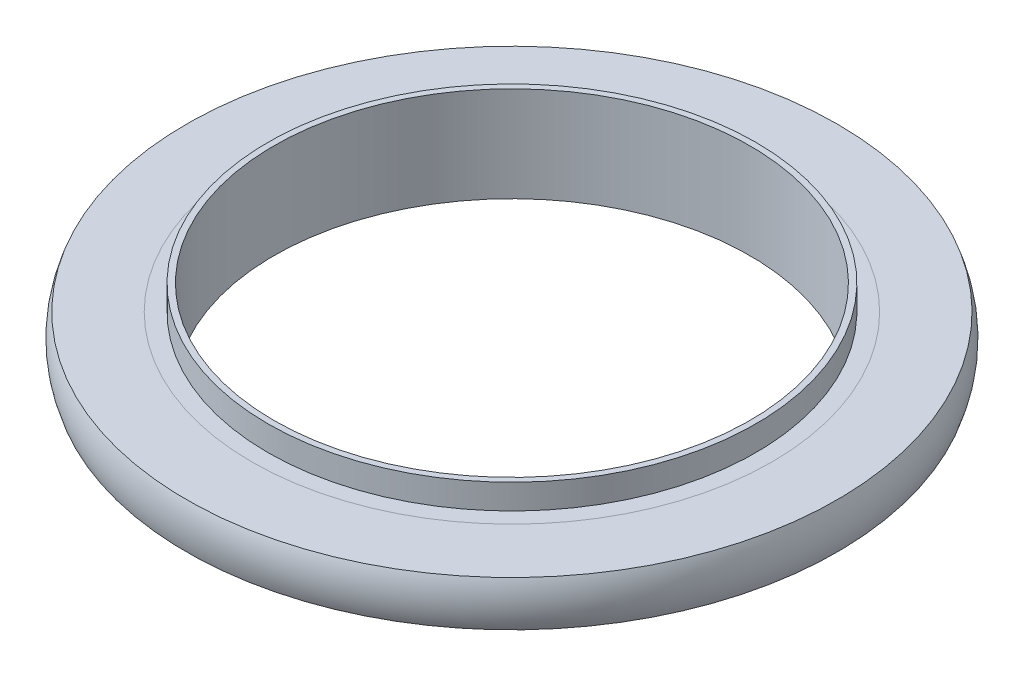
ISO-10303-21;
HEADER;
FILE_DESCRIPTION(('STEP AP214'),'2;1');
FILE_NAME('part.step','',(''),(''),'','','');
FILE_SCHEMA(('AUTOMOTIVE_DESIGN { 1 0 10303 214 1 1 1 1 }'));
ENDSEC;
DATA;
#1=APPLICATION_CONTEXT('core data for automotive mechanical design processes');
#2=APPLICATION_PROTOCOL_DEFINITION('international standard','automotive_design',2000,#1);
#3=PRODUCT_CONTEXT('',#1,'mechanical');
#4=PRODUCT('Part','Part','',(#3));
#5=PRODUCT_RELATED_PRODUCT_CATEGORY('part','',(#4));
#6=PRODUCT_DEFINITION_FORMATION('','',#4);
#7=PRODUCT_DEFINITION_CONTEXT('part definition',#1,'design');
#8=PRODUCT_DEFINITION('design','',#6,#7);
#9=PRODUCT_DEFINITION_SHAPE('','',#8);
#10=(LENGTH_UNIT() NAMED_UNIT(*) SI_UNIT(.MILLI.,.METRE.));
#11=(NAMED_UNIT(*) PLANE_ANGLE_UNIT() SI_UNIT($,.RADIAN.));
#12=(NAMED_UNIT(*) SI_UNIT($,.STERADIAN.) SOLID_ANGLE_UNIT());
#13=UNCERTAINTY_MEASURE_WITH_UNIT(LENGTH_MEASURE(1.E-05),#10,'distance_accuracy_value','');
#14=(GEOMETRIC_REPRESENTATION_CONTEXT(3) GLOBAL_UNCERTAINTY_ASSIGNED_CONTEXT((#13)) GLOBAL_UNIT_ASSIGNED_CONTEXT((#10,
#11,#12)) REPRESENTATION_CONTEXT('',''));
#15=CARTESIAN_POINT('',(0.,0.,0.));
#16=DIRECTION('',(0.,0.,1.));
#17=DIRECTION('',(1.,0.,0.));
#18=AXIS2_PLACEMENT_3D('',#15,#16,#17);
#19=CARTESIAN_POINT('',(0.,0.,0.));
#20=DIRECTION('',(0.,-1.,0.));
#21=DIRECTION('',(0.,0.,-1.));
#22=AXIS2_PLACEMENT_3D('',#19,#20,#21);
#23=TOROIDAL_SURFACE('',#22,26.8,5.3);
#24=CARTESIAN_POINT('',(0.,-1.905,0.));
#25=DIRECTION('',(0.,-1.,0.));
#26=DIRECTION('',(0.,0.,-1.));
#27=AXIS2_PLACEMENT_3D('',#24,#25,#26);
#28=CIRCLE('',#27,21.8541962230594);
#29=CARTESIAN_POINT('',(0.,-1.905,-21.8541962230594));
#30=VERTEX_POINT('',#29);
#31=EDGE_CURVE('E11',#30,#30,#28,.T.);
#32=ORIENTED_EDGE('',*,*,#31,.T.);
#33=EDGE_LOOP('',(#32));
#34=FACE_BOUND('',#33,.T.);
#35=CARTESIAN_POINT('',(0.,1.905,0.));
#36=DIRECTION('',(0.,-1.,0.));
#37=DIRECTION('',(0.,0.,-1.));
#38=AXIS2_PLACEMENT_3D('',#35,#36,#37);
#39=CIRCLE('',#38,21.8541962230594);
#40=CARTESIAN_POINT('',(0.,1.905,-21.8541962230594));
#41=VERTEX_POINT('',#40);
#42=EDGE_CURVE('E57',#41,#41,#39,.T.);
#43=ORIENTED_EDGE('',*,*,#42,.F.);
#44=EDGE_LOOP('',(#43));
#45=FACE_BOUND('',#44,.T.);
#46=ADVANCED_FACE('F43',(#34,#45),#23,.T.);
#47=CARTESIAN_POINT('',(21.8541962230594,-1.905,0.));
#48=DIRECTION('',(0.,-1.,0.));
#49=DIRECTION('',(0.,0.,-1.));
#50=AXIS2_PLACEMENT_3D('',#47,#48,#49);
#51=PLANE('',#50);
#52=CARTESIAN_POINT('',(0.,-1.905,0.));
#53=DIRECTION('',(0.,-1.,0.));
#54=DIRECTION('',(0.,0.,-1.));
#55=AXIS2_PLACEMENT_3D('',#52,#53,#54);
#56=CIRCLE('',#55,27.3458037769406);
#57=CARTESIAN_POINT('',(0.,-1.905,-27.3458037769406));
#58=VERTEX_POINT('',#57);
#59=EDGE_CURVE('E49',#58,#58,#56,.T.);
#60=ORIENTED_EDGE('',*,*,#59,.T.);
#61=EDGE_LOOP('',(#60));
#62=FACE_BOUND('',#61,.T.);
#63=ORIENTED_EDGE('',*,*,#31,.F.);
#64=EDGE_LOOP('',(#63));
#65=FACE_BOUND('',#64,.T.);
#66=ADVANCED_FACE('F67',(#62,#65),#51,.T.);
#67=CARTESIAN_POINT('',(0.,0.,0.));
#68=DIRECTION('',(0.,-1.,0.));
#69=DIRECTION('',(0.,0.,-1.));
#70=AXIS2_PLACEMENT_3D('',#67,#68,#69);
#71=TOROIDAL_SURFACE('',#70,22.4,5.3);
#72=CARTESIAN_POINT('',(0.,1.905,0.));
#73=DIRECTION('',(0.,-1.,0.));
#74=DIRECTION('',(0.,0.,-1.));
#75=AXIS2_PLACEMENT_3D('',#72,#73,#74);
#76=CIRCLE('',#75,27.3458037769406);
#77=CARTESIAN_POINT('',(0.,1.905,-27.3458037769406));
#78=VERTEX_POINT('',#77);
#79=EDGE_CURVE('E53',#78,#78,#76,.T.);
#80=ORIENTED_EDGE('',*,*,#79,.T.);
#81=EDGE_LOOP('',(#80));
#82=FACE_BOUND('',#81,.T.);
#83=ORIENTED_EDGE('',*,*,#59,.F.);
#84=EDGE_LOOP('',(#83));
#85=FACE_BOUND('',#84,.T.);
#86=ADVANCED_FACE('F71',(#82,#85),#71,.T.);
#87=CARTESIAN_POINT('',(21.8541962230594,1.905,0.));
#88=DIRECTION('',(0.,1.,0.));
#89=DIRECTION('',(0.,0.,1.));
#90=AXIS2_PLACEMENT_3D('',#87,#88,#89);
#91=PLANE('',#90);
#92=ORIENTED_EDGE('',*,*,#42,.T.);
#93=EDGE_LOOP('',(#92));
#94=FACE_BOUND('',#93,.T.);
#95=ORIENTED_EDGE('',*,*,#79,.F.);
#96=EDGE_LOOP('',(#95));
#97=FACE_BOUND('',#96,.T.);
#98=ADVANCED_FACE('F63',(#94,#97),#91,.T.);
#99=CLOSED_SHELL('',(#46,#66,#86,#98));
#100=MANIFOLD_SOLID_BREP('B2',#99);
#101=CARTESIAN_POINT('',(20.,4.,0.));
#102=DIRECTION('',(0.,-1.,0.));
#103=DIRECTION('',(0.,0.,-1.));
#104=AXIS2_PLACEMENT_3D('',#101,#102,#103);
#105=PLANE('',#104);
#106=CARTESIAN_POINT('',(0.,4.,0.));
#107=DIRECTION('',(0.,1.,0.));
#108=DIRECTION('',(0.,0.,1.));
#109=AXIS2_PLACEMENT_3D('',#106,#107,#108);
#110=CIRCLE('',#109,20.);
#111=CARTESIAN_POINT('',(0.,4.,20.));
#112=VERTEX_POINT('',#111);
#113=EDGE_CURVE('E42',#112,#112,#110,.T.);
#114=ORIENTED_EDGE('',*,*,#113,.F.);
#115=EDGE_LOOP('',(#114));
#116=FACE_BOUND('',#115,.T.);
#117=CARTESIAN_POINT('',(0.,4.,0.));
#118=DIRECTION('',(0.,1.,0.));
#119=DIRECTION('',(0.,0.,1.));
#120=AXIS2_PLACEMENT_3D('',#117,#118,#119);
#121=CIRCLE('',#120,20.5);
#122=CARTESIAN_POINT('',(0.,4.,20.5));
#123=VERTEX_POINT('',#122);
#124=EDGE_CURVE('E133',#123,#123,#121,.T.);
#125=ORIENTED_EDGE('',*,*,#124,.T.);
#126=EDGE_LOOP('',(#125));
#127=FACE_BOUND('',#126,.T.);
#128=ADVANCED_FACE('F105',(#116,#127),#105,.F.);
#129=CARTESIAN_POINT('',(0.,4.,0.));
#130=DIRECTION('',(0.,1.,0.));
#131=DIRECTION('',(0.,0.,1.));
#132=AXIS2_PLACEMENT_3D('',#129,#130,#131);
#133=CYLINDRICAL_SURFACE('',#132,20.);
#134=CARTESIAN_POINT('',(0.,-4.,0.));
#135=DIRECTION('',(0.,1.,0.));
#136=DIRECTION('',(0.,0.,1.));
#137=AXIS2_PLACEMENT_3D('',#134,#135,#136);
#138=CIRCLE('',#137,20.);
#139=CARTESIAN_POINT('',(0.,-4.,20.));
#140=VERTEX_POINT('',#139);
#141=EDGE_CURVE('E111',#140,#140,#138,.T.);
#142=ORIENTED_EDGE('',*,*,#141,.F.);
#143=EDGE_LOOP('',(#142));
#144=FACE_BOUND('',#143,.T.);
#145=ORIENTED_EDGE('',*,*,#113,.T.);
#146=EDGE_LOOP('',(#145));
#147=FACE_BOUND('',#146,.T.);
#148=ADVANCED_FACE('F170',(#144,#147),#133,.F.);
#149=CARTESIAN_POINT('',(20.,-4.,0.));
#150=DIRECTION('',(0.,1.,0.));
#151=DIRECTION('',(0.,0.,1.));
#152=AXIS2_PLACEMENT_3D('',#149,#150,#151);
#153=PLANE('',#152);
#154=CARTESIAN_POINT('',(0.,-4.,0.));
#155=DIRECTION('',(0.,1.,0.));
#156=DIRECTION('',(0.,0.,1.));
#157=AXIS2_PLACEMENT_3D('',#154,#155,#156);
#158=CIRCLE('',#157,20.5);
#159=CARTESIAN_POINT('',(0.,-4.,20.5));
#160=VERTEX_POINT('',#159);
#161=EDGE_CURVE('E115',#160,#160,#158,.T.);
#162=ORIENTED_EDGE('',*,*,#161,.F.);
#163=EDGE_LOOP('',(#162));
#164=FACE_BOUND('',#163,.T.);
#165=ORIENTED_EDGE('',*,*,#141,.T.);
#166=EDGE_LOOP('',(#165));
#167=FACE_BOUND('',#166,.T.);
#168=ADVANCED_FACE('F165',(#164,#167),#153,.F.);
#169=CARTESIAN_POINT('',(0.,4.,0.));
#170=DIRECTION('',(0.,1.,0.));
#171=DIRECTION('',(0.,0.,1.));
#172=AXIS2_PLACEMENT_3D('',#169,#170,#171);
#173=CYLINDRICAL_SURFACE('',#172,20.5);
#174=CARTESIAN_POINT('',(0.,-1.905,0.));
#175=DIRECTION('',(0.,1.,0.));
#176=DIRECTION('',(0.,0.,1.));
#177=AXIS2_PLACEMENT_3D('',#174,#175,#176);
#178=CIRCLE('',#177,20.5);
#179=CARTESIAN_POINT('',(0.,-1.905,20.5));
#180=VERTEX_POINT('',#179);
#181=EDGE_CURVE('E119',#180,#180,#178,.T.);
#182=ORIENTED_EDGE('',*,*,#181,.F.);
#183=EDGE_LOOP('',(#182));
#184=FACE_BOUND('',#183,.T.);
#185=ORIENTED_EDGE('',*,*,#161,.T.);
#186=EDGE_LOOP('',(#185));
#187=FACE_BOUND('',#186,.T.);
#188=ADVANCED_FACE('F159',(#184,#187),#173,.T.);
#189=CARTESIAN_POINT('',(20.5,-1.905,0.));
#190=DIRECTION('',(0.,1.,0.));
#191=DIRECTION('',(0.,0.,1.));
#192=AXIS2_PLACEMENT_3D('',#189,#190,#191);
#193=PLANE('',#192);
#194=CARTESIAN_POINT('',(0.,-1.905,0.));
#195=DIRECTION('',(0.,1.,0.));
#196=DIRECTION('',(0.,0.,1.));
#197=AXIS2_PLACEMENT_3D('',#194,#195,#196);
#198=CIRCLE('',#197,21.8541962230594);
#199=CARTESIAN_POINT('',(0.,-1.905,21.8541962230594));
#200=VERTEX_POINT('',#199);
#201=EDGE_CURVE('E124',#200,#200,#198,.T.);
#202=ORIENTED_EDGE('',*,*,#201,.F.);
#203=EDGE_LOOP('',(#202));
#204=FACE_BOUND('',#203,.T.);
#205=ORIENTED_EDGE('',*,*,#181,.T.);
#206=EDGE_LOOP('',(#205));
#207=FACE_BOUND('',#206,.T.);
#208=ADVANCED_FACE('F153',(#204,#207),#193,.F.);
#209=CARTESIAN_POINT('',(0.,0.,0.));
#210=DIRECTION('',(0.,1.,0.));
#211=DIRECTION('',(0.,0.,1.));
#212=AXIS2_PLACEMENT_3D('',#209,#210,#211);
#213=TOROIDAL_SURFACE('',#212,26.8,5.3);
#214=CARTESIAN_POINT('',(0.,1.905,0.));
#215=DIRECTION('',(0.,1.,0.));
#216=DIRECTION('',(0.,0.,1.));
#217=AXIS2_PLACEMENT_3D('',#214,#215,#216);
#218=CIRCLE('',#217,21.8541962230594);
#219=CARTESIAN_POINT('',(0.,1.905,21.8541962230594));
#220=VERTEX_POINT('',#219);
#221=EDGE_CURVE('E127',#220,#220,#218,.T.);
#222=ORIENTED_EDGE('',*,*,#221,.F.);
#223=EDGE_LOOP('',(#222));
#224=FACE_BOUND('',#223,.T.);
#225=ORIENTED_EDGE('',*,*,#201,.T.);
#226=EDGE_LOOP('',(#225));
#227=FACE_BOUND('',#226,.T.);
#228=ADVANCED_FACE('F147',(#224,#227),#213,.F.);
#229=CARTESIAN_POINT('',(20.5,1.905,0.));
#230=DIRECTION('',(0.,-1.,0.));
#231=DIRECTION('',(0.,0.,-1.));
#232=AXIS2_PLACEMENT_3D('',#229,#230,#231);
#233=PLANE('',#232);
#234=CARTESIAN_POINT('',(0.,1.905,0.));
#235=DIRECTION('',(0.,1.,0.));
#236=DIRECTION('',(0.,0.,1.));
#237=AXIS2_PLACEMENT_3D('',#234,#235,#236);
#238=CIRCLE('',#237,20.5);
#239=CARTESIAN_POINT('',(0.,1.905,20.5));
#240=VERTEX_POINT('',#239);
#241=EDGE_CURVE('E130',#240,#240,#238,.T.);
#242=ORIENTED_EDGE('',*,*,#241,.F.);
#243=EDGE_LOOP('',(#242));
#244=FACE_BOUND('',#243,.T.);
#245=ORIENTED_EDGE('',*,*,#221,.T.);
#246=EDGE_LOOP('',(#245));
#247=FACE_BOUND('',#246,.T.);
#248=ADVANCED_FACE('F141',(#244,#247),#233,.F.);
#249=CARTESIAN_POINT('',(0.,4.,0.));
#250=DIRECTION('',(0.,1.,0.));
#251=DIRECTION('',(0.,0.,1.));
#252=AXIS2_PLACEMENT_3D('',#249,#250,#251);
#253=CYLINDRICAL_SURFACE('',#252,20.5);
#254=ORIENTED_EDGE('',*,*,#124,.F.);
#255=EDGE_LOOP('',(#254));
#256=FACE_BOUND('',#255,.T.);
#257=ORIENTED_EDGE('',*,*,#241,.T.);
#258=EDGE_LOOP('',(#257));
#259=FACE_BOUND('',#258,.T.);
#260=ADVANCED_FACE('F138',(#256,#259),#253,.T.);
#261=CLOSED_SHELL('',(#128,#148,#168,#188,#208,#228,#248,#260));
#262=MANIFOLD_SOLID_BREP('B6',#261);
#263=ADVANCED_BREP_SHAPE_REPRESENTATION('',(#18,#100,#262),#14);
#264=SHAPE_DEFINITION_REPRESENTATION(#9,#263);
ENDSEC;
END-ISO-10303-21;
